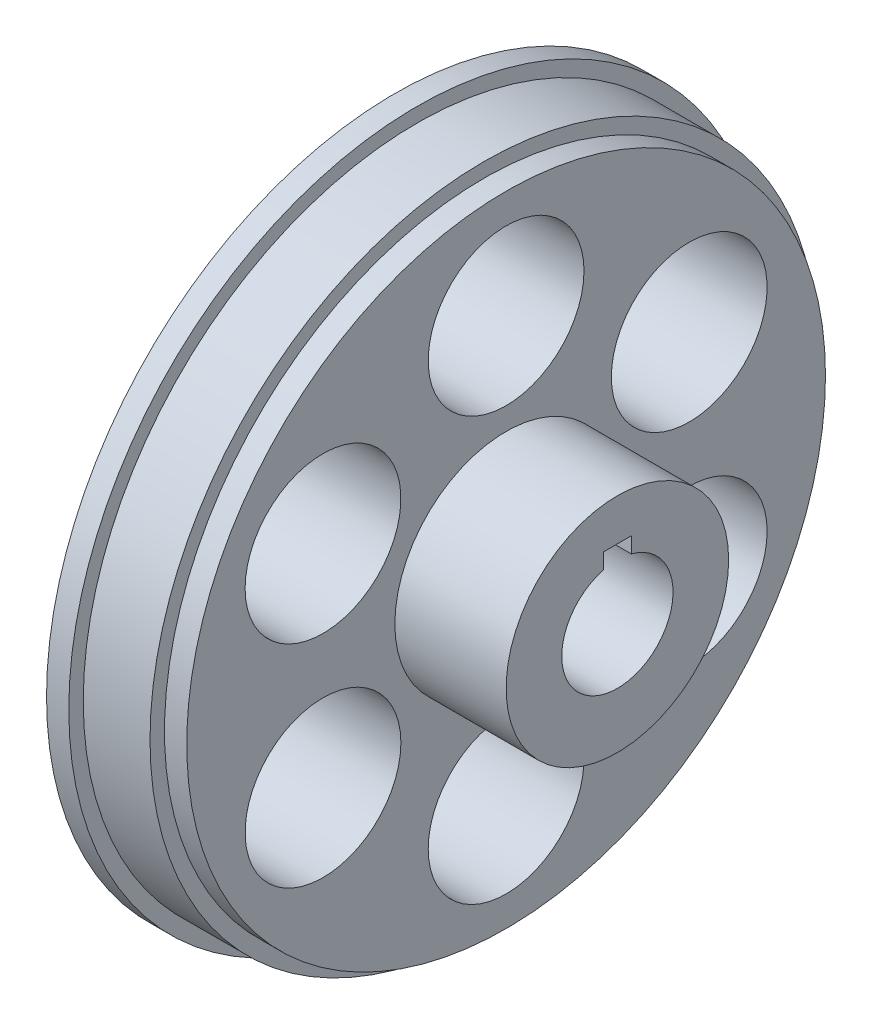
ISO-10303-21;
HEADER;
FILE_DESCRIPTION(('STEP AP214'),'2;1');
FILE_NAME('part.step','',(''),(''),'','','');
FILE_SCHEMA(('AUTOMOTIVE_DESIGN { 1 0 10303 214 1 1 1 1 }'));
ENDSEC;
DATA;
#1=APPLICATION_CONTEXT('core data for automotive mechanical design processes');
#2=APPLICATION_PROTOCOL_DEFINITION('international standard','automotive_design',2000,#1);
#3=PRODUCT_CONTEXT('',#1,'mechanical');
#4=PRODUCT('Part','Part','',(#3));
#5=PRODUCT_RELATED_PRODUCT_CATEGORY('part','',(#4));
#6=PRODUCT_DEFINITION_FORMATION('','',#4);
#7=PRODUCT_DEFINITION_CONTEXT('part definition',#1,'design');
#8=PRODUCT_DEFINITION('design','',#6,#7);
#9=PRODUCT_DEFINITION_SHAPE('','',#8);
#10=(LENGTH_UNIT() NAMED_UNIT(*) SI_UNIT(.MILLI.,.METRE.));
#11=(NAMED_UNIT(*) PLANE_ANGLE_UNIT() SI_UNIT($,.RADIAN.));
#12=(NAMED_UNIT(*) SI_UNIT($,.STERADIAN.) SOLID_ANGLE_UNIT());
#13=UNCERTAINTY_MEASURE_WITH_UNIT(LENGTH_MEASURE(1.E-05),#10,'distance_accuracy_value','');
#14=(GEOMETRIC_REPRESENTATION_CONTEXT(3) GLOBAL_UNCERTAINTY_ASSIGNED_CONTEXT((#13)) GLOBAL_UNIT_ASSIGNED_CONTEXT((#10,
#11,#12)) REPRESENTATION_CONTEXT('',''));
#15=CARTESIAN_POINT('',(0.,0.,0.));
#16=DIRECTION('',(0.,0.,1.));
#17=DIRECTION('',(1.,0.,0.));
#18=AXIS2_PLACEMENT_3D('',#15,#16,#17);
#19=CARTESIAN_POINT('',(12.7,0.,0.));
#20=DIRECTION('',(-1.,0.,0.));
#21=DIRECTION('',(0.,0.,1.));
#22=AXIS2_PLACEMENT_3D('',#19,#20,#21);
#23=CYLINDRICAL_SURFACE('',#22,38.1);
#24=CARTESIAN_POINT('',(2.54,0.,0.));
#25=DIRECTION('',(-1.,0.,0.));
#26=DIRECTION('',(0.,0.,1.));
#27=AXIS2_PLACEMENT_3D('',#24,#25,#26);
#28=CIRCLE('',#27,38.1);
#29=CARTESIAN_POINT('',(2.54,0.,38.1));
#30=VERTEX_POINT('',#29);
#31=EDGE_CURVE('E317',#30,#30,#28,.T.);
#32=ORIENTED_EDGE('',*,*,#31,.F.);
#33=EDGE_LOOP('',(#32));
#34=FACE_BOUND('',#33,.T.);
#35=CARTESIAN_POINT('',(10.16,0.,0.));
#36=DIRECTION('',(1.,0.,0.));
#37=DIRECTION('',(0.,0.,-1.));
#38=AXIS2_PLACEMENT_3D('',#35,#36,#37);
#39=CIRCLE('',#38,38.1);
#40=CARTESIAN_POINT('',(10.16,0.,-38.1));
#41=VERTEX_POINT('',#40);
#42=EDGE_CURVE('E312',#41,#41,#39,.T.);
#43=ORIENTED_EDGE('',*,*,#42,.F.);
#44=EDGE_LOOP('',(#43));
#45=FACE_BOUND('',#44,.T.);
#46=ADVANCED_FACE('F36',(#34,#45),#23,.T.);
#47=CARTESIAN_POINT('',(12.7,0.,0.));
#48=DIRECTION('',(-1.,0.,0.));
#49=DIRECTION('',(0.,0.,1.));
#50=AXIS2_PLACEMENT_3D('',#47,#48,#49);
#51=PLANE('',#50);
#52=CARTESIAN_POINT('',(12.7,0.,0.));
#53=DIRECTION('',(-1.,0.,0.));
#54=DIRECTION('',(0.,0.,1.));
#55=AXIS2_PLACEMENT_3D('',#52,#53,#54);
#56=CIRCLE('',#55,12.7);
#57=CARTESIAN_POINT('',(12.7,0.,12.7));
#58=VERTEX_POINT('',#57);
#59=EDGE_CURVE('E105',#58,#58,#56,.F.);
#60=ORIENTED_EDGE('',*,*,#59,.F.);
#61=EDGE_LOOP('',(#60));
#62=FACE_BOUND('',#61,.T.);
#63=CARTESIAN_POINT('',(12.7,24.13,0.));
#64=DIRECTION('',(1.,0.,0.));
#65=DIRECTION('',(0.,0.,-1.));
#66=AXIS2_PLACEMENT_3D('',#63,#64,#65);
#67=CIRCLE('',#66,8.89);
#68=CARTESIAN_POINT('',(12.7,24.13,-8.89));
#69=VERTEX_POINT('',#68);
#70=EDGE_CURVE('E354',#69,#69,#67,.T.);
#71=ORIENTED_EDGE('',*,*,#70,.F.);
#72=EDGE_LOOP('',(#71));
#73=FACE_BOUND('',#72,.T.);
#74=CARTESIAN_POINT('',(12.7,12.065,20.8971929933185));
#75=DIRECTION('',(1.,0.,0.));
#76=DIRECTION('',(0.,0.86602540378444,-0.499999999999998));
#77=AXIS2_PLACEMENT_3D('',#74,#75,#76);
#78=CIRCLE('',#77,8.89);
#79=CARTESIAN_POINT('',(12.7,19.7639658396436,16.4521929933186));
#80=VERTEX_POINT('',#79);
#81=EDGE_CURVE('E348',#80,#80,#78,.T.);
#82=ORIENTED_EDGE('',*,*,#81,.F.);
#83=EDGE_LOOP('',(#82));
#84=FACE_BOUND('',#83,.T.);
#85=CARTESIAN_POINT('',(12.7,-12.0650000000001,20.8971929933185));
#86=DIRECTION('',(1.,0.,0.));
#87=DIRECTION('',(0.,0.866025403784436,0.500000000000004));
#88=AXIS2_PLACEMENT_3D('',#85,#86,#87);
#89=CIRCLE('',#88,8.89);
#90=CARTESIAN_POINT('',(12.7,-4.36603416035646,25.3421929933185));
#91=VERTEX_POINT('',#90);
#92=EDGE_CURVE('E342',#91,#91,#89,.T.);
#93=ORIENTED_EDGE('',*,*,#92,.F.);
#94=EDGE_LOOP('',(#93));
#95=FACE_BOUND('',#94,.T.);
#96=CARTESIAN_POINT('',(12.7,-24.13,0.));
#97=DIRECTION('',(1.,0.,0.));
#98=DIRECTION('',(0.,0.,1.));
#99=AXIS2_PLACEMENT_3D('',#96,#97,#98);
#100=CIRCLE('',#99,8.89);
#101=CARTESIAN_POINT('',(12.7,-24.13,8.89));
#102=VERTEX_POINT('',#101);
#103=EDGE_CURVE('E336',#102,#102,#100,.T.);
#104=ORIENTED_EDGE('',*,*,#103,.F.);
#105=EDGE_LOOP('',(#104));
#106=FACE_BOUND('',#105,.T.);
#107=CARTESIAN_POINT('',(12.7,-12.0649999999998,-20.8971929933186));
#108=DIRECTION('',(1.,0.,0.));
#109=DIRECTION('',(0.,-0.866025403784443,0.499999999999992));
#110=AXIS2_PLACEMENT_3D('',#107,#108,#109);
#111=CIRCLE('',#110,8.89);
#112=CARTESIAN_POINT('',(12.7,-19.7639658396435,-16.4521929933187));
#113=VERTEX_POINT('',#112);
#114=EDGE_CURVE('E330',#113,#113,#111,.T.);
#115=ORIENTED_EDGE('',*,*,#114,.F.);
#116=EDGE_LOOP('',(#115));
#117=FACE_BOUND('',#116,.T.);
#118=CARTESIAN_POINT('',(12.7,12.0650000000002,-20.8971929933184));
#119=DIRECTION('',(1.,0.,0.));
#120=DIRECTION('',(0.,-0.866025403784433,-0.50000000000001));
#121=AXIS2_PLACEMENT_3D('',#118,#119,#120);
#122=CIRCLE('',#121,8.89);
#123=CARTESIAN_POINT('',(12.7,4.36603416035664,-25.3421929933185));
#124=VERTEX_POINT('',#123);
#125=EDGE_CURVE('E324',#124,#124,#122,.T.);
#126=ORIENTED_EDGE('',*,*,#125,.F.);
#127=EDGE_LOOP('',(#126));
#128=FACE_BOUND('',#127,.T.);
#129=CARTESIAN_POINT('',(12.7,0.,0.));
#130=DIRECTION('',(1.,0.,0.));
#131=DIRECTION('',(0.,0.,-1.));
#132=AXIS2_PLACEMENT_3D('',#129,#130,#131);
#133=CIRCLE('',#132,36.449);
#134=CARTESIAN_POINT('',(12.7,0.,-36.449));
#135=VERTEX_POINT('',#134);
#136=EDGE_CURVE('E309',#135,#135,#133,.T.);
#137=ORIENTED_EDGE('',*,*,#136,.T.);
#138=EDGE_LOOP('',(#137));
#139=FACE_BOUND('',#138,.T.);
#140=ADVANCED_FACE('F121',(#62,#73,#84,#95,#106,#117,#128,#139),#51,.F.);
#141=CARTESIAN_POINT('',(25.4,0.,0.));
#142=DIRECTION('',(1.,0.,0.));
#143=DIRECTION('',(0.,0.,-1.));
#144=AXIS2_PLACEMENT_3D('',#141,#142,#143);
#145=PLANE('',#144);
#146=CARTESIAN_POINT('',(25.4,0.,0.));
#147=DIRECTION('',(1.,0.,0.));
#148=DIRECTION('',(0.,0.,-1.));
#149=AXIS2_PLACEMENT_3D('',#146,#147,#148);
#150=CIRCLE('',#149,6.35);
#151=CARTESIAN_POINT('',(25.4,6.14836106210428,1.5875));
#152=VERTEX_POINT('',#151);
#153=CARTESIAN_POINT('',(25.4,6.14836106210427,-1.5875));
#154=VERTEX_POINT('',#153);
#155=EDGE_CURVE('E95',#152,#154,#150,.T.);
#156=ORIENTED_EDGE('',*,*,#155,.F.);
#157=DIRECTION('',(0.,-1.,0.));
#158=VECTOR('',#157,1.);
#159=CARTESIAN_POINT('',(25.4,0.,1.5875));
#160=LINE('',#159,#158);
#161=CARTESIAN_POINT('',(25.4,7.9375,1.5875));
#162=VERTEX_POINT('',#161);
#163=EDGE_CURVE('E86',#162,#152,#160,.T.);
#164=ORIENTED_EDGE('',*,*,#163,.F.);
#165=DIRECTION('',(0.,0.,-1.));
#166=VECTOR('',#165,1.);
#167=CARTESIAN_POINT('',(25.4,7.9375,0.));
#168=LINE('',#167,#166);
#169=CARTESIAN_POINT('',(25.4,7.9375,-1.5875));
#170=VERTEX_POINT('',#169);
#171=EDGE_CURVE('E90',#162,#170,#168,.T.);
#172=ORIENTED_EDGE('',*,*,#171,.T.);
#173=DIRECTION('',(0.,-1.,0.));
#174=VECTOR('',#173,1.);
#175=CARTESIAN_POINT('',(25.4,0.,-1.5875));
#176=LINE('',#175,#174);
#177=EDGE_CURVE('E53',#170,#154,#176,.T.);
#178=ORIENTED_EDGE('',*,*,#177,.T.);
#179=EDGE_LOOP('',(#156,#164,#172,#178));
#180=FACE_BOUND('',#179,.T.);
#181=CARTESIAN_POINT('',(25.4,0.,0.));
#182=DIRECTION('',(1.,0.,0.));
#183=DIRECTION('',(0.,0.,-1.));
#184=AXIS2_PLACEMENT_3D('',#181,#182,#183);
#185=CIRCLE('',#184,12.7);
#186=CARTESIAN_POINT('',(25.4,0.,-12.7));
#187=VERTEX_POINT('',#186);
#188=EDGE_CURVE('E360',#187,#187,#185,.T.);
#189=ORIENTED_EDGE('',*,*,#188,.T.);
#190=EDGE_LOOP('',(#189));
#191=FACE_BOUND('',#190,.T.);
#192=ADVANCED_FACE('F93',(#180,#191),#145,.T.);
#193=CARTESIAN_POINT('',(25.4,0.,0.));
#194=DIRECTION('',(-1.,0.,0.));
#195=DIRECTION('',(0.,0.,1.));
#196=AXIS2_PLACEMENT_3D('',#193,#194,#195);
#197=CYLINDRICAL_SURFACE('',#196,6.35);
#198=CARTESIAN_POINT('',(0.,0.,0.));
#199=DIRECTION('',(1.,0.,0.));
#200=DIRECTION('',(0.,0.,-1.));
#201=AXIS2_PLACEMENT_3D('',#198,#199,#200);
#202=CIRCLE('',#201,6.35);
#203=CARTESIAN_POINT('',(0.,6.14836106210428,1.5875));
#204=VERTEX_POINT('',#203);
#205=CARTESIAN_POINT('',(0.,6.14836106210427,-1.5875));
#206=VERTEX_POINT('',#205);
#207=EDGE_CURVE('E102',#204,#206,#202,.T.);
#208=ORIENTED_EDGE('',*,*,#207,.F.);
#209=DIRECTION('',(-1.,0.,0.));
#210=VECTOR('',#209,1.);
#211=CARTESIAN_POINT('',(25.4,6.14836106210428,1.5875));
#212=LINE('',#211,#210);
#213=EDGE_CURVE('E11',#152,#204,#212,.T.);
#214=ORIENTED_EDGE('',*,*,#213,.F.);
#215=ORIENTED_EDGE('',*,*,#155,.T.);
#216=DIRECTION('',(-1.,0.,0.));
#217=VECTOR('',#216,1.);
#218=CARTESIAN_POINT('',(25.4,6.14836106210427,-1.5875));
#219=LINE('',#218,#217);
#220=EDGE_CURVE('E75',#154,#206,#219,.T.);
#221=ORIENTED_EDGE('',*,*,#220,.T.);
#222=EDGE_LOOP('',(#208,#214,#215,#221));
#223=FACE_BOUND('',#222,.T.);
#224=ADVANCED_FACE('F38',(#223),#197,.F.);
#225=CARTESIAN_POINT('',(25.4,0.,1.5875));
#226=DIRECTION('',(0.,0.,-1.));
#227=DIRECTION('',(0.,1.,0.));
#228=AXIS2_PLACEMENT_3D('',#225,#226,#227);
#229=PLANE('',#228);
#230=DIRECTION('',(0.,-1.,0.));
#231=VECTOR('',#230,1.);
#232=CARTESIAN_POINT('',(0.,0.,1.5875));
#233=LINE('',#232,#231);
#234=CARTESIAN_POINT('',(0.,7.9375,1.5875));
#235=VERTEX_POINT('',#234);
#236=EDGE_CURVE('E88',#235,#204,#233,.T.);
#237=ORIENTED_EDGE('',*,*,#236,.F.);
#238=DIRECTION('',(-1.,0.,0.));
#239=VECTOR('',#238,1.);
#240=CARTESIAN_POINT('',(25.4,7.9375,1.5875));
#241=LINE('',#240,#239);
#242=EDGE_CURVE('E45',#162,#235,#241,.T.);
#243=ORIENTED_EDGE('',*,*,#242,.F.);
#244=ORIENTED_EDGE('',*,*,#163,.T.);
#245=ORIENTED_EDGE('',*,*,#213,.T.);
#246=EDGE_LOOP('',(#237,#243,#244,#245));
#247=FACE_BOUND('',#246,.T.);
#248=ADVANCED_FACE('F84',(#247),#229,.T.);
#249=CARTESIAN_POINT('',(25.4,7.9375,0.));
#250=DIRECTION('',(0.,1.,0.));
#251=DIRECTION('',(0.,0.,1.));
#252=AXIS2_PLACEMENT_3D('',#249,#250,#251);
#253=PLANE('',#252);
#254=DIRECTION('',(0.,0.,-1.));
#255=VECTOR('',#254,1.);
#256=CARTESIAN_POINT('',(0.,7.9375,0.));
#257=LINE('',#256,#255);
#258=CARTESIAN_POINT('',(0.,7.9375,-1.5875));
#259=VERTEX_POINT('',#258);
#260=EDGE_CURVE('E68',#235,#259,#257,.T.);
#261=ORIENTED_EDGE('',*,*,#260,.T.);
#262=DIRECTION('',(-1.,0.,0.));
#263=VECTOR('',#262,1.);
#264=CARTESIAN_POINT('',(25.4,7.9375,-1.5875));
#265=LINE('',#264,#263);
#266=EDGE_CURVE('E89',#170,#259,#265,.T.);
#267=ORIENTED_EDGE('',*,*,#266,.F.);
#268=ORIENTED_EDGE('',*,*,#171,.F.);
#269=ORIENTED_EDGE('',*,*,#242,.T.);
#270=EDGE_LOOP('',(#261,#267,#268,#269));
#271=FACE_BOUND('',#270,.T.);
#272=ADVANCED_FACE('F91',(#271),#253,.F.);
#273=CARTESIAN_POINT('',(25.4,0.,-1.5875));
#274=DIRECTION('',(0.,0.,-1.));
#275=DIRECTION('',(0.,1.,0.));
#276=AXIS2_PLACEMENT_3D('',#273,#274,#275);
#277=PLANE('',#276);
#278=DIRECTION('',(0.,-1.,0.));
#279=VECTOR('',#278,1.);
#280=CARTESIAN_POINT('',(0.,0.,-1.5875));
#281=LINE('',#280,#279);
#282=EDGE_CURVE('E97',#259,#206,#281,.T.);
#283=ORIENTED_EDGE('',*,*,#282,.T.);
#284=ORIENTED_EDGE('',*,*,#220,.F.);
#285=ORIENTED_EDGE('',*,*,#177,.F.);
#286=ORIENTED_EDGE('',*,*,#266,.T.);
#287=EDGE_LOOP('',(#283,#284,#285,#286));
#288=FACE_BOUND('',#287,.T.);
#289=ADVANCED_FACE('F112',(#288),#277,.F.);
#290=CARTESIAN_POINT('',(0.,0.,0.));
#291=DIRECTION('',(1.,0.,0.));
#292=DIRECTION('',(0.,0.,-1.));
#293=AXIS2_PLACEMENT_3D('',#290,#291,#292);
#294=PLANE('',#293);
#295=CARTESIAN_POINT('',(0.,12.0650000000002,-20.8971929933184));
#296=DIRECTION('',(1.,0.,0.));
#297=DIRECTION('',(0.,-0.866025403784433,-0.50000000000001));
#298=AXIS2_PLACEMENT_3D('',#295,#296,#297);
#299=CIRCLE('',#298,8.89);
#300=CARTESIAN_POINT('',(0.,4.36603416035664,-25.3421929933185));
#301=VERTEX_POINT('',#300);
#302=EDGE_CURVE('E327',#301,#301,#299,.T.);
#303=ORIENTED_EDGE('',*,*,#302,.T.);
#304=EDGE_LOOP('',(#303));
#305=FACE_BOUND('',#304,.T.);
#306=CARTESIAN_POINT('',(0.,-12.0649999999998,-20.8971929933186));
#307=DIRECTION('',(1.,0.,0.));
#308=DIRECTION('',(0.,-0.866025403784443,0.499999999999992));
#309=AXIS2_PLACEMENT_3D('',#306,#307,#308);
#310=CIRCLE('',#309,8.89);
#311=CARTESIAN_POINT('',(0.,-19.7639658396435,-16.4521929933187));
#312=VERTEX_POINT('',#311);
#313=EDGE_CURVE('E333',#312,#312,#310,.T.);
#314=ORIENTED_EDGE('',*,*,#313,.T.);
#315=EDGE_LOOP('',(#314));
#316=FACE_BOUND('',#315,.T.);
#317=CARTESIAN_POINT('',(0.,-24.13,0.));
#318=DIRECTION('',(1.,0.,0.));
#319=DIRECTION('',(0.,0.,1.));
#320=AXIS2_PLACEMENT_3D('',#317,#318,#319);
#321=CIRCLE('',#320,8.89);
#322=CARTESIAN_POINT('',(0.,-24.13,8.89));
#323=VERTEX_POINT('',#322);
#324=EDGE_CURVE('E339',#323,#323,#321,.T.);
#325=ORIENTED_EDGE('',*,*,#324,.T.);
#326=EDGE_LOOP('',(#325));
#327=FACE_BOUND('',#326,.T.);
#328=CARTESIAN_POINT('',(0.,-12.0650000000001,20.8971929933185));
#329=DIRECTION('',(1.,0.,0.));
#330=DIRECTION('',(0.,0.866025403784436,0.500000000000004));
#331=AXIS2_PLACEMENT_3D('',#328,#329,#330);
#332=CIRCLE('',#331,8.89);
#333=CARTESIAN_POINT('',(0.,-4.36603416035646,25.3421929933185));
#334=VERTEX_POINT('',#333);
#335=EDGE_CURVE('E345',#334,#334,#332,.T.);
#336=ORIENTED_EDGE('',*,*,#335,.T.);
#337=EDGE_LOOP('',(#336));
#338=FACE_BOUND('',#337,.T.);
#339=CARTESIAN_POINT('',(0.,12.065,20.8971929933185));
#340=DIRECTION('',(1.,0.,0.));
#341=DIRECTION('',(0.,0.86602540378444,-0.499999999999998));
#342=AXIS2_PLACEMENT_3D('',#339,#340,#341);
#343=CIRCLE('',#342,8.89);
#344=CARTESIAN_POINT('',(0.,19.7639658396436,16.4521929933186));
#345=VERTEX_POINT('',#344);
#346=EDGE_CURVE('E351',#345,#345,#343,.T.);
#347=ORIENTED_EDGE('',*,*,#346,.T.);
#348=EDGE_LOOP('',(#347));
#349=FACE_BOUND('',#348,.T.);
#350=CARTESIAN_POINT('',(0.,24.13,0.));
#351=DIRECTION('',(1.,0.,0.));
#352=DIRECTION('',(0.,0.,-1.));
#353=AXIS2_PLACEMENT_3D('',#350,#351,#352);
#354=CIRCLE('',#353,8.89);
#355=CARTESIAN_POINT('',(0.,24.13,-8.89));
#356=VERTEX_POINT('',#355);
#357=EDGE_CURVE('E357',#356,#356,#354,.T.);
#358=ORIENTED_EDGE('',*,*,#357,.T.);
#359=EDGE_LOOP('',(#358));
#360=FACE_BOUND('',#359,.T.);
#361=ORIENTED_EDGE('',*,*,#207,.T.);
#362=ORIENTED_EDGE('',*,*,#282,.F.);
#363=ORIENTED_EDGE('',*,*,#260,.F.);
#364=ORIENTED_EDGE('',*,*,#236,.T.);
#365=EDGE_LOOP('',(#361,#362,#363,#364));
#366=FACE_BOUND('',#365,.T.);
#367=CARTESIAN_POINT('',(0.,0.,0.));
#368=DIRECTION('',(-1.,0.,0.));
#369=DIRECTION('',(0.,0.,1.));
#370=AXIS2_PLACEMENT_3D('',#367,#368,#369);
#371=CIRCLE('',#370,39.751);
#372=CARTESIAN_POINT('',(0.,0.,39.751));
#373=VERTEX_POINT('',#372);
#374=EDGE_CURVE('E320',#373,#373,#371,.T.);
#375=ORIENTED_EDGE('',*,*,#374,.T.);
#376=EDGE_LOOP('',(#375));
#377=FACE_BOUND('',#376,.T.);
#378=ADVANCED_FACE('F114',(#305,#316,#327,#338,#349,#360,#366,#377),#294,.F.);
#379=CARTESIAN_POINT('',(-59.1420489685532,0.,0.));
#380=DIRECTION('',(1.,0.,0.));
#381=DIRECTION('',(0.,0.,-1.));
#382=AXIS2_PLACEMENT_3D('',#379,#380,#381);
#383=CYLINDRICAL_SURFACE('',#382,12.7);
#384=ORIENTED_EDGE('',*,*,#188,.F.);
#385=EDGE_LOOP('',(#384));
#386=FACE_BOUND('',#385,.T.);
#387=ORIENTED_EDGE('',*,*,#59,.T.);
#388=EDGE_LOOP('',(#387));
#389=FACE_BOUND('',#388,.T.);
#390=ADVANCED_FACE('F137',(#386,#389),#383,.T.);
#391=CARTESIAN_POINT('',(0.,24.13,0.));
#392=DIRECTION('',(1.,0.,0.));
#393=DIRECTION('',(0.,0.,-1.));
#394=AXIS2_PLACEMENT_3D('',#391,#392,#393);
#395=CYLINDRICAL_SURFACE('',#394,8.89);
#396=ORIENTED_EDGE('',*,*,#357,.F.);
#397=EDGE_LOOP('',(#396));
#398=FACE_BOUND('',#397,.T.);
#399=ORIENTED_EDGE('',*,*,#70,.T.);
#400=EDGE_LOOP('',(#399));
#401=FACE_BOUND('',#400,.T.);
#402=ADVANCED_FACE('F163',(#398,#401),#395,.F.);
#403=CARTESIAN_POINT('',(0.,12.065,20.8971929933185));
#404=DIRECTION('',(1.,0.,0.));
#405=DIRECTION('',(0.,0.,-1.));
#406=AXIS2_PLACEMENT_3D('',#403,#404,#405);
#407=CYLINDRICAL_SURFACE('',#406,8.89);
#408=ORIENTED_EDGE('',*,*,#346,.F.);
#409=EDGE_LOOP('',(#408));
#410=FACE_BOUND('',#409,.T.);
#411=ORIENTED_EDGE('',*,*,#81,.T.);
#412=EDGE_LOOP('',(#411));
#413=FACE_BOUND('',#412,.T.);
#414=ADVANCED_FACE('F170',(#410,#413),#407,.F.);
#415=CARTESIAN_POINT('',(0.,-12.0650000000001,20.8971929933185));
#416=DIRECTION('',(1.,0.,0.));
#417=DIRECTION('',(0.,0.,-1.));
#418=AXIS2_PLACEMENT_3D('',#415,#416,#417);
#419=CYLINDRICAL_SURFACE('',#418,8.89);
#420=ORIENTED_EDGE('',*,*,#335,.F.);
#421=EDGE_LOOP('',(#420));
#422=FACE_BOUND('',#421,.T.);
#423=ORIENTED_EDGE('',*,*,#92,.T.);
#424=EDGE_LOOP('',(#423));
#425=FACE_BOUND('',#424,.T.);
#426=ADVANCED_FACE('F178',(#422,#425),#419,.F.);
#427=CARTESIAN_POINT('',(0.,-24.13,0.));
#428=DIRECTION('',(1.,0.,0.));
#429=DIRECTION('',(0.,0.,-1.));
#430=AXIS2_PLACEMENT_3D('',#427,#428,#429);
#431=CYLINDRICAL_SURFACE('',#430,8.89);
#432=ORIENTED_EDGE('',*,*,#324,.F.);
#433=EDGE_LOOP('',(#432));
#434=FACE_BOUND('',#433,.T.);
#435=ORIENTED_EDGE('',*,*,#103,.T.);
#436=EDGE_LOOP('',(#435));
#437=FACE_BOUND('',#436,.T.);
#438=ADVANCED_FACE('F186',(#434,#437),#431,.F.);
#439=CARTESIAN_POINT('',(0.,-12.0649999999998,-20.8971929933186));
#440=DIRECTION('',(1.,0.,0.));
#441=DIRECTION('',(0.,0.,-1.));
#442=AXIS2_PLACEMENT_3D('',#439,#440,#441);
#443=CYLINDRICAL_SURFACE('',#442,8.89);
#444=ORIENTED_EDGE('',*,*,#313,.F.);
#445=EDGE_LOOP('',(#444));
#446=FACE_BOUND('',#445,.T.);
#447=ORIENTED_EDGE('',*,*,#114,.T.);
#448=EDGE_LOOP('',(#447));
#449=FACE_BOUND('',#448,.T.);
#450=ADVANCED_FACE('F194',(#446,#449),#443,.F.);
#451=CARTESIAN_POINT('',(0.,12.0650000000002,-20.8971929933184));
#452=DIRECTION('',(1.,0.,0.));
#453=DIRECTION('',(0.,0.,-1.));
#454=AXIS2_PLACEMENT_3D('',#451,#452,#453);
#455=CYLINDRICAL_SURFACE('',#454,8.89);
#456=ORIENTED_EDGE('',*,*,#302,.F.);
#457=EDGE_LOOP('',(#456));
#458=FACE_BOUND('',#457,.T.);
#459=ORIENTED_EDGE('',*,*,#125,.T.);
#460=EDGE_LOOP('',(#459));
#461=FACE_BOUND('',#460,.T.);
#462=ADVANCED_FACE('F202',(#458,#461),#455,.F.);
#463=CARTESIAN_POINT('',(2.54,0.,0.));
#464=DIRECTION('',(-1.,0.,0.));
#465=DIRECTION('',(0.,0.,1.));
#466=AXIS2_PLACEMENT_3D('',#463,#464,#465);
#467=CYLINDRICAL_SURFACE('',#466,39.751);
#468=CARTESIAN_POINT('',(2.54,0.,0.));
#469=DIRECTION('',(-1.,0.,0.));
#470=DIRECTION('',(0.,0.,1.));
#471=AXIS2_PLACEMENT_3D('',#468,#469,#470);
#472=CIRCLE('',#471,39.751);
#473=CARTESIAN_POINT('',(2.54,0.,39.751));
#474=VERTEX_POINT('',#473);
#475=EDGE_CURVE('E321',#474,#474,#472,.T.);
#476=ORIENTED_EDGE('',*,*,#475,.T.);
#477=EDGE_LOOP('',(#476));
#478=FACE_BOUND('',#477,.T.);
#479=ORIENTED_EDGE('',*,*,#374,.F.);
#480=EDGE_LOOP('',(#479));
#481=FACE_BOUND('',#480,.T.);
#482=ADVANCED_FACE('F209',(#478,#481),#467,.T.);
#483=CARTESIAN_POINT('',(2.54,0.,0.));
#484=DIRECTION('',(-1.,0.,0.));
#485=DIRECTION('',(0.,0.,1.));
#486=AXIS2_PLACEMENT_3D('',#483,#484,#485);
#487=PLANE('',#486);
#488=ORIENTED_EDGE('',*,*,#31,.T.);
#489=EDGE_LOOP('',(#488));
#490=FACE_BOUND('',#489,.T.);
#491=ORIENTED_EDGE('',*,*,#475,.F.);
#492=EDGE_LOOP('',(#491));
#493=FACE_BOUND('',#492,.T.);
#494=ADVANCED_FACE('F216',(#490,#493),#487,.F.);
#495=CARTESIAN_POINT('',(10.16,0.,0.));
#496=DIRECTION('',(1.,0.,0.));
#497=DIRECTION('',(0.,0.,-1.));
#498=AXIS2_PLACEMENT_3D('',#495,#496,#497);
#499=PLANE('',#498);
#500=CARTESIAN_POINT('',(10.16,0.,0.));
#501=DIRECTION('',(1.,0.,0.));
#502=DIRECTION('',(0.,0.,-1.));
#503=AXIS2_PLACEMENT_3D('',#500,#501,#502);
#504=CIRCLE('',#503,36.449);
#505=CARTESIAN_POINT('',(10.16,0.,-36.449));
#506=VERTEX_POINT('',#505);
#507=EDGE_CURVE('E306',#506,#506,#504,.T.);
#508=ORIENTED_EDGE('',*,*,#507,.F.);
#509=EDGE_LOOP('',(#508));
#510=FACE_BOUND('',#509,.T.);
#511=ORIENTED_EDGE('',*,*,#42,.T.);
#512=EDGE_LOOP('',(#511));
#513=FACE_BOUND('',#512,.T.);
#514=ADVANCED_FACE('F224',(#510,#513),#499,.T.);
#515=CARTESIAN_POINT('',(10.16,0.,0.));
#516=DIRECTION('',(1.,0.,0.));
#517=DIRECTION('',(0.,0.,-1.));
#518=AXIS2_PLACEMENT_3D('',#515,#516,#517);
#519=CYLINDRICAL_SURFACE('',#518,36.449);
#520=ORIENTED_EDGE('',*,*,#507,.T.);
#521=EDGE_LOOP('',(#520));
#522=FACE_BOUND('',#521,.T.);
#523=ORIENTED_EDGE('',*,*,#136,.F.);
#524=EDGE_LOOP('',(#523));
#525=FACE_BOUND('',#524,.T.);
#526=ADVANCED_FACE('F232',(#522,#525),#519,.T.);
#527=CLOSED_SHELL('',(#46,#140,#192,#224,#248,#272,#289,#378,#390,#402,#414,#426,#438,#450,#462,
#482,#494,#514,#526));
#528=MANIFOLD_SOLID_BREP('B2',#527);
#529=ADVANCED_BREP_SHAPE_REPRESENTATION('',(#18,#528),#14);
#530=SHAPE_DEFINITION_REPRESENTATION(#9,#529);
ENDSEC;
END-ISO-10303-21;
